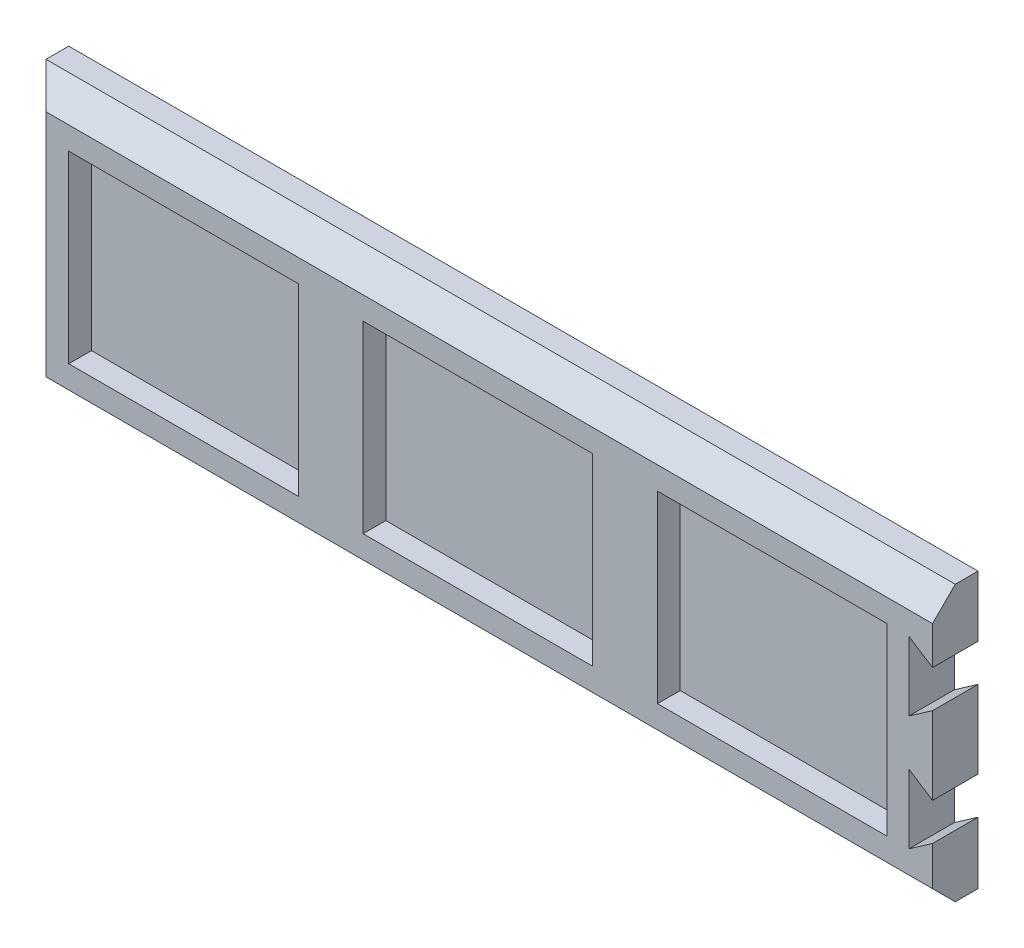
ISO-10303-21;
HEADER;
FILE_DESCRIPTION(('STEP AP214'),'2;1');
FILE_NAME('part.step','',(''),(''),'','','');
FILE_SCHEMA(('AUTOMOTIVE_DESIGN { 1 0 10303 214 1 1 1 1 }'));
ENDSEC;
DATA;
#1=APPLICATION_CONTEXT('core data for automotive mechanical design processes');
#2=APPLICATION_PROTOCOL_DEFINITION('international standard','automotive_design',2000,#1);
#3=PRODUCT_CONTEXT('',#1,'mechanical');
#4=PRODUCT('Part','Part','',(#3));
#5=PRODUCT_RELATED_PRODUCT_CATEGORY('part','',(#4));
#6=PRODUCT_DEFINITION_FORMATION('','',#4);
#7=PRODUCT_DEFINITION_CONTEXT('part definition',#1,'design');
#8=PRODUCT_DEFINITION('design','',#6,#7);
#9=PRODUCT_DEFINITION_SHAPE('','',#8);
#10=(LENGTH_UNIT() NAMED_UNIT(*) SI_UNIT(.MILLI.,.METRE.));
#11=(NAMED_UNIT(*) PLANE_ANGLE_UNIT() SI_UNIT($,.RADIAN.));
#12=(NAMED_UNIT(*) SI_UNIT($,.STERADIAN.) SOLID_ANGLE_UNIT());
#13=UNCERTAINTY_MEASURE_WITH_UNIT(LENGTH_MEASURE(1.E-05),#10,'distance_accuracy_value','');
#14=(GEOMETRIC_REPRESENTATION_CONTEXT(3) GLOBAL_UNCERTAINTY_ASSIGNED_CONTEXT((#13)) GLOBAL_UNIT_ASSIGNED_CONTEXT((#10,
#11,#12)) REPRESENTATION_CONTEXT('',''));
#15=CARTESIAN_POINT('',(0.,0.,0.));
#16=DIRECTION('',(0.,0.,1.));
#17=DIRECTION('',(1.,0.,0.));
#18=AXIS2_PLACEMENT_3D('',#15,#16,#17);
#19=CARTESIAN_POINT('',(200.,30.25,10.));
#20=DIRECTION('',(-1.,0.,0.));
#21=DIRECTION('',(0.,0.,1.));
#22=AXIS2_PLACEMENT_3D('',#19,#20,#21);
#23=PLANE('',#22);
#24=DIRECTION('',(0.,1.,0.));
#25=VECTOR('',#24,1.);
#26=CARTESIAN_POINT('',(200.,30.25,0.));
#27=LINE('',#26,#25);
#28=CARTESIAN_POINT('',(200.,-8.426374254982,0.));
#29=VERTEX_POINT('',#28);
#30=CARTESIAN_POINT('',(200.,8.673625745018,0.));
#31=VERTEX_POINT('',#30);
#32=EDGE_CURVE('E238',#29,#31,#27,.T.);
#33=ORIENTED_EDGE('',*,*,#32,.T.);
#34=DIRECTION('',(0.,0.,1.));
#35=VECTOR('',#34,1.);
#36=CARTESIAN_POINT('',(200.,8.673625745018,0.));
#37=LINE('',#36,#35);
#38=CARTESIAN_POINT('',(200.,8.673625745018,10.));
#39=VERTEX_POINT('',#38);
#40=EDGE_CURVE('E280',#31,#39,#37,.T.);
#41=ORIENTED_EDGE('',*,*,#40,.T.);
#42=DIRECTION('',(0.,1.,0.));
#43=VECTOR('',#42,1.);
#44=CARTESIAN_POINT('',(200.,30.25,10.));
#45=LINE('',#44,#43);
#46=CARTESIAN_POINT('',(200.,-8.426374254982,10.));
#47=VERTEX_POINT('',#46);
#48=EDGE_CURVE('E253',#47,#39,#45,.T.);
#49=ORIENTED_EDGE('',*,*,#48,.F.);
#50=DIRECTION('',(0.,0.,1.));
#51=VECTOR('',#50,1.);
#52=CARTESIAN_POINT('',(200.,-8.426374254982,0.));
#53=LINE('',#52,#51);
#54=EDGE_CURVE('E306',#29,#47,#53,.T.);
#55=ORIENTED_EDGE('',*,*,#54,.F.);
#56=EDGE_LOOP('',(#33,#41,#49,#55));
#57=FACE_BOUND('',#56,.T.);
#58=ADVANCED_FACE('F38',(#57),#23,.F.);
#59=CARTESIAN_POINT('',(200.,-30.25,0.));
#60=VERTEX_POINT('',#59);
#61=CARTESIAN_POINT('',(200.,-16.626374254982,0.));
#62=VERTEX_POINT('',#61);
#63=EDGE_CURVE('E241',#60,#62,#27,.T.);
#64=ORIENTED_EDGE('',*,*,#63,.T.);
#65=DIRECTION('',(0.,0.,1.));
#66=VECTOR('',#65,1.);
#67=CARTESIAN_POINT('',(200.,-16.626374254982,0.));
#68=LINE('',#67,#66);
#69=CARTESIAN_POINT('',(200.,-16.626374254982,10.));
#70=VERTEX_POINT('',#69);
#71=EDGE_CURVE('E314',#62,#70,#68,.T.);
#72=ORIENTED_EDGE('',*,*,#71,.T.);
#73=CARTESIAN_POINT('',(200.,-25.25,10.));
#74=VERTEX_POINT('',#73);
#75=EDGE_CURVE('E255',#74,#70,#45,.T.);
#76=ORIENTED_EDGE('',*,*,#75,.F.);
#77=DIRECTION('',(0.,-0.707106781186546,-0.707106781186549));
#78=VECTOR('',#77,1.);
#79=CARTESIAN_POINT('',(200.,-25.25,10.));
#80=LINE('',#79,#78);
#81=CARTESIAN_POINT('',(200.,-30.25,4.99999999999994));
#82=VERTEX_POINT('',#81);
#83=EDGE_CURVE('E274',#74,#82,#80,.T.);
#84=ORIENTED_EDGE('',*,*,#83,.T.);
#85=DIRECTION('',(0.,0.,-1.));
#86=VECTOR('',#85,1.);
#87=CARTESIAN_POINT('',(200.,-30.25,10.));
#88=LINE('',#87,#86);
#89=EDGE_CURVE('E261',#82,#60,#88,.T.);
#90=ORIENTED_EDGE('',*,*,#89,.T.);
#91=EDGE_LOOP('',(#64,#72,#76,#84,#90));
#92=FACE_BOUND('',#91,.T.);
#93=ADVANCED_FACE('F435',(#92),#23,.F.);
#94=CARTESIAN_POINT('',(0.,30.25,10.));
#95=DIRECTION('',(1.,0.,0.));
#96=DIRECTION('',(0.,0.,-1.));
#97=AXIS2_PLACEMENT_3D('',#94,#95,#96);
#98=PLANE('',#97);
#99=DIRECTION('',(0.,0.,-1.));
#100=VECTOR('',#99,1.);
#101=CARTESIAN_POINT('',(0.,-30.25,10.));
#102=LINE('',#101,#100);
#103=CARTESIAN_POINT('',(0.,-30.25,4.99999999999994));
#104=VERTEX_POINT('',#103);
#105=CARTESIAN_POINT('',(0.,-30.25,0.));
#106=VERTEX_POINT('',#105);
#107=EDGE_CURVE('E263',#104,#106,#102,.T.);
#108=ORIENTED_EDGE('',*,*,#107,.F.);
#109=DIRECTION('',(0.,1.,0.));
#110=VECTOR('',#109,1.);
#111=CARTESIAN_POINT('',(0.,30.25,4.99999999999994));
#112=LINE('',#111,#110);
#113=CARTESIAN_POINT('',(0.,30.25,4.99999999999994));
#114=VERTEX_POINT('',#113);
#115=EDGE_CURVE('E11',#104,#114,#112,.T.);
#116=ORIENTED_EDGE('',*,*,#115,.T.);
#117=DIRECTION('',(0.,0.,-1.));
#118=VECTOR('',#117,1.);
#119=CARTESIAN_POINT('',(0.,30.25,10.));
#120=LINE('',#119,#118);
#121=CARTESIAN_POINT('',(0.,30.25,0.));
#122=VERTEX_POINT('',#121);
#123=EDGE_CURVE('E257',#114,#122,#120,.T.);
#124=ORIENTED_EDGE('',*,*,#123,.T.);
#125=DIRECTION('',(0.,-1.,0.));
#126=VECTOR('',#125,1.);
#127=CARTESIAN_POINT('',(0.,30.25,0.));
#128=LINE('',#127,#126);
#129=EDGE_CURVE('E244',#122,#106,#128,.T.);
#130=ORIENTED_EDGE('',*,*,#129,.T.);
#131=EDGE_LOOP('',(#108,#116,#124,#130));
#132=FACE_BOUND('',#131,.T.);
#133=ADVANCED_FACE('F421',(#132),#98,.F.);
#134=CARTESIAN_POINT('',(0.,-30.25,10.));
#135=DIRECTION('',(0.,1.,0.));
#136=DIRECTION('',(0.,0.,1.));
#137=AXIS2_PLACEMENT_3D('',#134,#135,#136);
#138=PLANE('',#137);
#139=ORIENTED_EDGE('',*,*,#89,.F.);
#140=DIRECTION('',(-1.,0.,0.));
#141=VECTOR('',#140,1.);
#142=CARTESIAN_POINT('',(0.,-30.25,4.99999999999994));
#143=LINE('',#142,#141);
#144=EDGE_CURVE('E276',#82,#104,#143,.T.);
#145=ORIENTED_EDGE('',*,*,#144,.T.);
#146=ORIENTED_EDGE('',*,*,#107,.T.);
#147=DIRECTION('',(1.,0.,0.));
#148=VECTOR('',#147,1.);
#149=CARTESIAN_POINT('',(0.,-30.25,0.));
#150=LINE('',#149,#148);
#151=EDGE_CURVE('E239',#106,#60,#150,.T.);
#152=ORIENTED_EDGE('',*,*,#151,.T.);
#153=EDGE_LOOP('',(#139,#145,#146,#152));
#154=FACE_BOUND('',#153,.T.);
#155=ADVANCED_FACE('F426',(#154),#138,.F.);
#156=CARTESIAN_POINT('',(200.,16.873625745018,10.));
#157=VERTEX_POINT('',#156);
#158=CARTESIAN_POINT('',(200.,25.25,10.));
#159=VERTEX_POINT('',#158);
#160=EDGE_CURVE('E230',#157,#159,#45,.T.);
#161=ORIENTED_EDGE('',*,*,#160,.F.);
#162=DIRECTION('',(0.,0.,1.));
#163=VECTOR('',#162,1.);
#164=CARTESIAN_POINT('',(200.,16.873625745018,0.));
#165=LINE('',#164,#163);
#166=CARTESIAN_POINT('',(200.,16.873625745018,0.));
#167=VERTEX_POINT('',#166);
#168=EDGE_CURVE('E216',#167,#157,#165,.T.);
#169=ORIENTED_EDGE('',*,*,#168,.F.);
#170=CARTESIAN_POINT('',(200.,30.25,0.));
#171=VERTEX_POINT('',#170);
#172=EDGE_CURVE('E227',#167,#171,#27,.T.);
#173=ORIENTED_EDGE('',*,*,#172,.T.);
#174=DIRECTION('',(0.,0.,-1.));
#175=VECTOR('',#174,1.);
#176=CARTESIAN_POINT('',(200.,30.25,10.));
#177=LINE('',#176,#175);
#178=CARTESIAN_POINT('',(200.,30.25,4.99999999999994));
#179=VERTEX_POINT('',#178);
#180=EDGE_CURVE('E259',#179,#171,#177,.T.);
#181=ORIENTED_EDGE('',*,*,#180,.F.);
#182=DIRECTION('',(0.,-0.707106781186546,0.707106781186549));
#183=VECTOR('',#182,1.);
#184=CARTESIAN_POINT('',(200.,25.25,10.));
#185=LINE('',#184,#183);
#186=EDGE_CURVE('E272',#179,#159,#185,.T.);
#187=ORIENTED_EDGE('',*,*,#186,.T.);
#188=EDGE_LOOP('',(#161,#169,#173,#181,#187));
#189=FACE_BOUND('',#188,.T.);
#190=ADVANCED_FACE('F225',(#189),#23,.F.);
#191=CARTESIAN_POINT('',(0.,30.25,10.));
#192=DIRECTION('',(0.,-1.,0.));
#193=DIRECTION('',(0.,0.,-1.));
#194=AXIS2_PLACEMENT_3D('',#191,#192,#193);
#195=PLANE('',#194);
#196=ORIENTED_EDGE('',*,*,#123,.F.);
#197=DIRECTION('',(1.,0.,0.));
#198=VECTOR('',#197,1.);
#199=CARTESIAN_POINT('',(200.,30.25,4.99999999999994));
#200=LINE('',#199,#198);
#201=EDGE_CURVE('E48',#114,#179,#200,.T.);
#202=ORIENTED_EDGE('',*,*,#201,.T.);
#203=ORIENTED_EDGE('',*,*,#180,.T.);
#204=DIRECTION('',(-1.,0.,0.));
#205=VECTOR('',#204,1.);
#206=CARTESIAN_POINT('',(0.,30.25,0.));
#207=LINE('',#206,#205);
#208=EDGE_CURVE('E237',#171,#122,#207,.T.);
#209=ORIENTED_EDGE('',*,*,#208,.T.);
#210=EDGE_LOOP('',(#196,#202,#203,#209));
#211=FACE_BOUND('',#210,.T.);
#212=ADVANCED_FACE('F465',(#211),#195,.F.);
#213=CARTESIAN_POINT('',(0.,0.,10.));
#214=DIRECTION('',(0.,0.,1.));
#215=DIRECTION('',(1.,0.,0.));
#216=AXIS2_PLACEMENT_3D('',#213,#214,#215);
#217=PLANE('',#216);
#218=DIRECTION('',(0.820443806514334,0.571727173004982,0.));
#219=VECTOR('',#218,1.);
#220=CARTESIAN_POINT('',(194.8,5.05,10.));
#221=LINE('',#220,#219);
#222=CARTESIAN_POINT('',(194.8,5.05,10.));
#223=VERTEX_POINT('',#222);
#224=EDGE_CURVE('E221',#223,#39,#221,.T.);
#225=ORIENTED_EDGE('',*,*,#224,.F.);
#226=DIRECTION('',(0.,-1.,0.));
#227=VECTOR('',#226,1.);
#228=CARTESIAN_POINT('',(194.8,20.25,10.));
#229=LINE('',#228,#227);
#230=CARTESIAN_POINT('',(194.8,20.25,10.));
#231=VERTEX_POINT('',#230);
#232=EDGE_CURVE('E495',#231,#223,#229,.T.);
#233=ORIENTED_EDGE('',*,*,#232,.F.);
#234=DIRECTION('',(-0.838710734430041,0.544577179058966,0.));
#235=VECTOR('',#234,1.);
#236=CARTESIAN_POINT('',(200.,16.873625745018,10.));
#237=LINE('',#236,#235);
#238=EDGE_CURVE('E316',#157,#231,#237,.T.);
#239=ORIENTED_EDGE('',*,*,#238,.F.);
#240=ORIENTED_EDGE('',*,*,#160,.T.);
#241=DIRECTION('',(-1.,0.,0.));
#242=VECTOR('',#241,1.);
#243=CARTESIAN_POINT('',(0.,25.25,10.));
#244=LINE('',#243,#242);
#245=CARTESIAN_POINT('',(5.00000000000003,25.25,10.));
#246=VERTEX_POINT('',#245);
#247=EDGE_CURVE('E267',#159,#246,#244,.T.);
#248=ORIENTED_EDGE('',*,*,#247,.T.);
#249=DIRECTION('',(0.,-1.,0.));
#250=VECTOR('',#249,1.);
#251=CARTESIAN_POINT('',(5.00000000000003,-30.25,10.));
#252=LINE('',#251,#250);
#253=CARTESIAN_POINT('',(5.00000000000003,-25.25,10.));
#254=VERTEX_POINT('',#253);
#255=EDGE_CURVE('E265',#246,#254,#252,.T.);
#256=ORIENTED_EDGE('',*,*,#255,.T.);
#257=DIRECTION('',(1.,0.,0.));
#258=VECTOR('',#257,1.);
#259=CARTESIAN_POINT('',(200.,-25.25,10.));
#260=LINE('',#259,#258);
#261=EDGE_CURVE('E269',#254,#74,#260,.T.);
#262=ORIENTED_EDGE('',*,*,#261,.T.);
#263=ORIENTED_EDGE('',*,*,#75,.T.);
#264=DIRECTION('',(0.820443806514335,0.571727173004982,0.));
#265=VECTOR('',#264,1.);
#266=CARTESIAN_POINT('',(194.8,-20.25,10.));
#267=LINE('',#266,#265);
#268=CARTESIAN_POINT('',(194.8,-20.25,10.));
#269=VERTEX_POINT('',#268);
#270=EDGE_CURVE('E301',#269,#70,#267,.T.);
#271=ORIENTED_EDGE('',*,*,#270,.F.);
#272=DIRECTION('',(0.,-1.,0.));
#273=VECTOR('',#272,1.);
#274=CARTESIAN_POINT('',(194.8,-5.05,10.));
#275=LINE('',#274,#273);
#276=CARTESIAN_POINT('',(194.8,-5.05,10.));
#277=VERTEX_POINT('',#276);
#278=EDGE_CURVE('E310',#277,#269,#275,.T.);
#279=ORIENTED_EDGE('',*,*,#278,.F.);
#280=DIRECTION('',(-0.83871073443004,0.544577179058967,0.));
#281=VECTOR('',#280,1.);
#282=CARTESIAN_POINT('',(200.,-8.426374254982,10.));
#283=LINE('',#282,#281);
#284=EDGE_CURVE('E307',#47,#277,#283,.T.);
#285=ORIENTED_EDGE('',*,*,#284,.F.);
#286=ORIENTED_EDGE('',*,*,#48,.T.);
#287=EDGE_LOOP('',(#225,#233,#239,#240,#248,#256,#262,#263,#271,#279,#285,#286));
#288=FACE_BOUND('',#287,.T.);
#289=DIRECTION('',(0.,-1.,0.));
#290=VECTOR('',#289,1.);
#291=CARTESIAN_POINT('',(10.,20.25,10.));
#292=LINE('',#291,#290);
#293=CARTESIAN_POINT('',(10.,20.25,10.));
#294=VERTEX_POINT('',#293);
#295=CARTESIAN_POINT('',(10.,-20.25,10.));
#296=VERTEX_POINT('',#295);
#297=EDGE_CURVE('E336',#294,#296,#292,.T.);
#298=ORIENTED_EDGE('',*,*,#297,.F.);
#299=DIRECTION('',(-1.,0.,0.));
#300=VECTOR('',#299,1.);
#301=CARTESIAN_POINT('',(10.,20.25,10.));
#302=LINE('',#301,#300);
#303=CARTESIAN_POINT('',(60.5,20.25,10.));
#304=VERTEX_POINT('',#303);
#305=EDGE_CURVE('E326',#304,#294,#302,.T.);
#306=ORIENTED_EDGE('',*,*,#305,.F.);
#307=DIRECTION('',(0.,1.,0.));
#308=VECTOR('',#307,1.);
#309=CARTESIAN_POINT('',(60.5,20.25,10.));
#310=LINE('',#309,#308);
#311=CARTESIAN_POINT('',(60.5,-20.25,10.));
#312=VERTEX_POINT('',#311);
#313=EDGE_CURVE('E342',#312,#304,#310,.T.);
#314=ORIENTED_EDGE('',*,*,#313,.F.);
#315=DIRECTION('',(1.,0.,0.));
#316=VECTOR('',#315,1.);
#317=CARTESIAN_POINT('',(10.,-20.25,10.));
#318=LINE('',#317,#316);
#319=EDGE_CURVE('E338',#296,#312,#318,.T.);
#320=ORIENTED_EDGE('',*,*,#319,.F.);
#321=EDGE_LOOP('',(#298,#306,#314,#320));
#322=FACE_BOUND('',#321,.T.);
#323=DIRECTION('',(-1.,0.,0.));
#324=VECTOR('',#323,1.);
#325=CARTESIAN_POINT('',(74.75,20.25,10.));
#326=LINE('',#325,#324);
#327=CARTESIAN_POINT('',(125.25,20.25,10.));
#328=VERTEX_POINT('',#327);
#329=CARTESIAN_POINT('',(74.75,20.25,10.));
#330=VERTEX_POINT('',#329);
#331=EDGE_CURVE('E369',#328,#330,#326,.T.);
#332=ORIENTED_EDGE('',*,*,#331,.F.);
#333=DIRECTION('',(0.,1.,0.));
#334=VECTOR('',#333,1.);
#335=CARTESIAN_POINT('',(125.25,20.25,10.));
#336=LINE('',#335,#334);
#337=CARTESIAN_POINT('',(125.25,-20.25,10.));
#338=VERTEX_POINT('',#337);
#339=EDGE_CURVE('E359',#338,#328,#336,.T.);
#340=ORIENTED_EDGE('',*,*,#339,.F.);
#341=DIRECTION('',(1.,0.,0.));
#342=VECTOR('',#341,1.);
#343=CARTESIAN_POINT('',(74.75,-20.25,10.));
#344=LINE('',#343,#342);
#345=CARTESIAN_POINT('',(74.75,-20.25,10.));
#346=VERTEX_POINT('',#345);
#347=EDGE_CURVE('E375',#346,#338,#344,.T.);
#348=ORIENTED_EDGE('',*,*,#347,.F.);
#349=DIRECTION('',(0.,-1.,0.));
#350=VECTOR('',#349,1.);
#351=CARTESIAN_POINT('',(74.75,20.25,10.));
#352=LINE('',#351,#350);
#353=EDGE_CURVE('E371',#330,#346,#352,.T.);
#354=ORIENTED_EDGE('',*,*,#353,.F.);
#355=EDGE_LOOP('',(#332,#340,#348,#354));
#356=FACE_BOUND('',#355,.T.);
#357=DIRECTION('',(-1.,0.,0.));
#358=VECTOR('',#357,1.);
#359=CARTESIAN_POINT('',(139.5,20.25,10.));
#360=LINE('',#359,#358);
#361=CARTESIAN_POINT('',(190.,20.25,10.));
#362=VERTEX_POINT('',#361);
#363=CARTESIAN_POINT('',(139.5,20.25,10.));
#364=VERTEX_POINT('',#363);
#365=EDGE_CURVE('E286',#362,#364,#360,.T.);
#366=ORIENTED_EDGE('',*,*,#365,.F.);
#367=DIRECTION('',(0.,1.,0.));
#368=VECTOR('',#367,1.);
#369=CARTESIAN_POINT('',(190.,20.25,10.));
#370=LINE('',#369,#368);
#371=CARTESIAN_POINT('',(190.,-20.25,10.));
#372=VERTEX_POINT('',#371);
#373=EDGE_CURVE('E391',#372,#362,#370,.T.);
#374=ORIENTED_EDGE('',*,*,#373,.F.);
#375=DIRECTION('',(1.,0.,0.));
#376=VECTOR('',#375,1.);
#377=CARTESIAN_POINT('',(139.5,-20.25,10.));
#378=LINE('',#377,#376);
#379=CARTESIAN_POINT('',(139.5,-20.25,10.));
#380=VERTEX_POINT('',#379);
#381=EDGE_CURVE('E405',#380,#372,#378,.T.);
#382=ORIENTED_EDGE('',*,*,#381,.F.);
#383=DIRECTION('',(0.,-1.,0.));
#384=VECTOR('',#383,1.);
#385=CARTESIAN_POINT('',(139.5,20.25,10.));
#386=LINE('',#385,#384);
#387=EDGE_CURVE('E402',#364,#380,#386,.T.);
#388=ORIENTED_EDGE('',*,*,#387,.F.);
#389=EDGE_LOOP('',(#366,#374,#382,#388));
#390=FACE_BOUND('',#389,.T.);
#391=ADVANCED_FACE('F431',(#288,#322,#356,#390),#217,.T.);
#392=CARTESIAN_POINT('',(0.,0.,0.));
#393=DIRECTION('',(0.,0.,1.));
#394=DIRECTION('',(1.,0.,0.));
#395=AXIS2_PLACEMENT_3D('',#392,#393,#394);
#396=PLANE('',#395);
#397=DIRECTION('',(0.,-1.,0.));
#398=VECTOR('',#397,1.);
#399=CARTESIAN_POINT('',(194.8,20.25,0.));
#400=LINE('',#399,#398);
#401=CARTESIAN_POINT('',(194.8,20.25,0.));
#402=VERTEX_POINT('',#401);
#403=CARTESIAN_POINT('',(194.8,5.05,0.));
#404=VERTEX_POINT('',#403);
#405=EDGE_CURVE('E56',#402,#404,#400,.T.);
#406=ORIENTED_EDGE('',*,*,#405,.T.);
#407=DIRECTION('',(0.820443806514334,0.571727173004982,0.));
#408=VECTOR('',#407,1.);
#409=CARTESIAN_POINT('',(194.8,5.05,0.));
#410=LINE('',#409,#408);
#411=EDGE_CURVE('E231',#404,#31,#410,.T.);
#412=ORIENTED_EDGE('',*,*,#411,.T.);
#413=ORIENTED_EDGE('',*,*,#32,.F.);
#414=DIRECTION('',(-0.83871073443004,0.544577179058967,0.));
#415=VECTOR('',#414,1.);
#416=CARTESIAN_POINT('',(200.,-8.426374254982,0.));
#417=LINE('',#416,#415);
#418=CARTESIAN_POINT('',(194.8,-5.04999999999997,0.));
#419=VERTEX_POINT('',#418);
#420=EDGE_CURVE('E298',#29,#419,#417,.T.);
#421=ORIENTED_EDGE('',*,*,#420,.T.);
#422=DIRECTION('',(0.,-1.,0.));
#423=VECTOR('',#422,1.);
#424=CARTESIAN_POINT('',(194.8,-5.05,0.));
#425=LINE('',#424,#423);
#426=CARTESIAN_POINT('',(194.8,-20.25,0.));
#427=VERTEX_POINT('',#426);
#428=EDGE_CURVE('E64',#419,#427,#425,.T.);
#429=ORIENTED_EDGE('',*,*,#428,.T.);
#430=DIRECTION('',(0.820443806514335,0.571727173004982,0.));
#431=VECTOR('',#430,1.);
#432=CARTESIAN_POINT('',(194.8,-20.25,0.));
#433=LINE('',#432,#431);
#434=EDGE_CURVE('E303',#427,#62,#433,.T.);
#435=ORIENTED_EDGE('',*,*,#434,.T.);
#436=ORIENTED_EDGE('',*,*,#63,.F.);
#437=ORIENTED_EDGE('',*,*,#151,.F.);
#438=ORIENTED_EDGE('',*,*,#129,.F.);
#439=ORIENTED_EDGE('',*,*,#208,.F.);
#440=ORIENTED_EDGE('',*,*,#172,.F.);
#441=DIRECTION('',(-0.838710734430041,0.544577179058966,0.));
#442=VECTOR('',#441,1.);
#443=CARTESIAN_POINT('',(200.,16.873625745018,0.));
#444=LINE('',#443,#442);
#445=EDGE_CURVE('E212',#167,#402,#444,.T.);
#446=ORIENTED_EDGE('',*,*,#445,.T.);
#447=EDGE_LOOP('',(#406,#412,#413,#421,#429,#435,#436,#437,#438,#439,#440,#446));
#448=FACE_BOUND('',#447,.T.);
#449=ADVANCED_FACE('F234',(#448),#396,.F.);
#450=CARTESIAN_POINT('',(139.5,20.25,5.));
#451=DIRECTION('',(0.,1.,0.));
#452=DIRECTION('',(-1.,0.,0.));
#453=AXIS2_PLACEMENT_3D('',#450,#451,#452);
#454=PLANE('',#453);
#455=ORIENTED_EDGE('',*,*,#365,.T.);
#456=DIRECTION('',(0.,0.,1.));
#457=VECTOR('',#456,1.);
#458=CARTESIAN_POINT('',(139.5,20.25,5.));
#459=LINE('',#458,#457);
#460=CARTESIAN_POINT('',(139.5,20.25,5.));
#461=VERTEX_POINT('',#460);
#462=EDGE_CURVE('E400',#461,#364,#459,.T.);
#463=ORIENTED_EDGE('',*,*,#462,.F.);
#464=DIRECTION('',(-1.,0.,0.));
#465=VECTOR('',#464,1.);
#466=CARTESIAN_POINT('',(139.5,20.25,5.));
#467=LINE('',#466,#465);
#468=CARTESIAN_POINT('',(190.,20.25,5.));
#469=VERTEX_POINT('',#468);
#470=EDGE_CURVE('E387',#469,#461,#467,.T.);
#471=ORIENTED_EDGE('',*,*,#470,.F.);
#472=DIRECTION('',(0.,0.,1.));
#473=VECTOR('',#472,1.);
#474=CARTESIAN_POINT('',(190.,20.25,5.));
#475=LINE('',#474,#473);
#476=EDGE_CURVE('E372',#469,#362,#475,.T.);
#477=ORIENTED_EDGE('',*,*,#476,.T.);
#478=EDGE_LOOP('',(#455,#463,#471,#477));
#479=FACE_BOUND('',#478,.T.);
#480=ADVANCED_FACE('F536',(#479),#454,.F.);
#481=CARTESIAN_POINT('',(190.,20.25,5.));
#482=DIRECTION('',(1.,0.,0.));
#483=DIRECTION('',(0.,0.,-1.));
#484=AXIS2_PLACEMENT_3D('',#481,#482,#483);
#485=PLANE('',#484);
#486=ORIENTED_EDGE('',*,*,#373,.T.);
#487=ORIENTED_EDGE('',*,*,#476,.F.);
#488=DIRECTION('',(0.,1.,0.));
#489=VECTOR('',#488,1.);
#490=CARTESIAN_POINT('',(190.,20.25,5.));
#491=LINE('',#490,#489);
#492=CARTESIAN_POINT('',(190.,-20.25,5.));
#493=VERTEX_POINT('',#492);
#494=EDGE_CURVE('E397',#493,#469,#491,.T.);
#495=ORIENTED_EDGE('',*,*,#494,.F.);
#496=DIRECTION('',(0.,0.,1.));
#497=VECTOR('',#496,1.);
#498=CARTESIAN_POINT('',(190.,-20.25,5.));
#499=LINE('',#498,#497);
#500=EDGE_CURVE('E411',#493,#372,#499,.T.);
#501=ORIENTED_EDGE('',*,*,#500,.T.);
#502=EDGE_LOOP('',(#486,#487,#495,#501));
#503=FACE_BOUND('',#502,.T.);
#504=ADVANCED_FACE('F720',(#503),#485,.F.);
#505=CARTESIAN_POINT('',(139.5,-20.25,5.));
#506=DIRECTION('',(0.,-1.,0.));
#507=DIRECTION('',(1.,0.,0.));
#508=AXIS2_PLACEMENT_3D('',#505,#506,#507);
#509=PLANE('',#508);
#510=ORIENTED_EDGE('',*,*,#381,.T.);
#511=ORIENTED_EDGE('',*,*,#500,.F.);
#512=DIRECTION('',(1.,0.,0.));
#513=VECTOR('',#512,1.);
#514=CARTESIAN_POINT('',(139.5,-20.25,5.));
#515=LINE('',#514,#513);
#516=CARTESIAN_POINT('',(139.5,-20.25,5.));
#517=VERTEX_POINT('',#516);
#518=EDGE_CURVE('E394',#517,#493,#515,.T.);
#519=ORIENTED_EDGE('',*,*,#518,.F.);
#520=DIRECTION('',(0.,0.,1.));
#521=VECTOR('',#520,1.);
#522=CARTESIAN_POINT('',(139.5,-20.25,5.));
#523=LINE('',#522,#521);
#524=EDGE_CURVE('E413',#517,#380,#523,.T.);
#525=ORIENTED_EDGE('',*,*,#524,.T.);
#526=EDGE_LOOP('',(#510,#511,#519,#525));
#527=FACE_BOUND('',#526,.T.);
#528=ADVANCED_FACE('F710',(#527),#509,.F.);
#529=CARTESIAN_POINT('',(139.5,20.25,5.));
#530=DIRECTION('',(-1.,0.,0.));
#531=DIRECTION('',(0.,0.,1.));
#532=AXIS2_PLACEMENT_3D('',#529,#530,#531);
#533=PLANE('',#532);
#534=ORIENTED_EDGE('',*,*,#387,.T.);
#535=ORIENTED_EDGE('',*,*,#524,.F.);
#536=DIRECTION('',(0.,-1.,0.));
#537=VECTOR('',#536,1.);
#538=CARTESIAN_POINT('',(139.5,20.25,5.));
#539=LINE('',#538,#537);
#540=EDGE_CURVE('E390',#461,#517,#539,.T.);
#541=ORIENTED_EDGE('',*,*,#540,.F.);
#542=ORIENTED_EDGE('',*,*,#462,.T.);
#543=EDGE_LOOP('',(#534,#535,#541,#542));
#544=FACE_BOUND('',#543,.T.);
#545=ADVANCED_FACE('F700',(#544),#533,.F.);
#546=CARTESIAN_POINT('',(0.,0.,5.));
#547=DIRECTION('',(0.,0.,-1.));
#548=DIRECTION('',(-1.,0.,0.));
#549=AXIS2_PLACEMENT_3D('',#546,#547,#548);
#550=PLANE('',#549);
#551=ORIENTED_EDGE('',*,*,#470,.T.);
#552=ORIENTED_EDGE('',*,*,#540,.T.);
#553=ORIENTED_EDGE('',*,*,#518,.T.);
#554=ORIENTED_EDGE('',*,*,#494,.T.);
#555=EDGE_LOOP('',(#551,#552,#553,#554));
#556=FACE_BOUND('',#555,.T.);
#557=ADVANCED_FACE('F690',(#556),#550,.F.);
#558=CARTESIAN_POINT('',(74.75,20.25,5.));
#559=DIRECTION('',(0.,1.,0.));
#560=DIRECTION('',(-1.,0.,0.));
#561=AXIS2_PLACEMENT_3D('',#558,#559,#560);
#562=PLANE('',#561);
#563=ORIENTED_EDGE('',*,*,#331,.T.);
#564=DIRECTION('',(0.,0.,1.));
#565=VECTOR('',#564,1.);
#566=CARTESIAN_POINT('',(74.75,20.25,5.));
#567=LINE('',#566,#565);
#568=CARTESIAN_POINT('',(74.75,20.25,5.));
#569=VERTEX_POINT('',#568);
#570=EDGE_CURVE('E368',#569,#330,#567,.T.);
#571=ORIENTED_EDGE('',*,*,#570,.F.);
#572=DIRECTION('',(-1.,0.,0.));
#573=VECTOR('',#572,1.);
#574=CARTESIAN_POINT('',(74.75,20.25,5.));
#575=LINE('',#574,#573);
#576=CARTESIAN_POINT('',(125.25,20.25,5.));
#577=VERTEX_POINT('',#576);
#578=EDGE_CURVE('E355',#577,#569,#575,.T.);
#579=ORIENTED_EDGE('',*,*,#578,.F.);
#580=DIRECTION('',(0.,0.,1.));
#581=VECTOR('',#580,1.);
#582=CARTESIAN_POINT('',(125.25,20.25,5.));
#583=LINE('',#582,#581);
#584=EDGE_CURVE('E339',#577,#328,#583,.T.);
#585=ORIENTED_EDGE('',*,*,#584,.T.);
#586=EDGE_LOOP('',(#563,#571,#579,#585));
#587=FACE_BOUND('',#586,.T.);
#588=ADVANCED_FACE('F680',(#587),#562,.F.);
#589=CARTESIAN_POINT('',(125.25,20.25,5.));
#590=DIRECTION('',(1.,0.,0.));
#591=DIRECTION('',(0.,0.,-1.));
#592=AXIS2_PLACEMENT_3D('',#589,#590,#591);
#593=PLANE('',#592);
#594=ORIENTED_EDGE('',*,*,#339,.T.);
#595=ORIENTED_EDGE('',*,*,#584,.F.);
#596=DIRECTION('',(0.,1.,0.));
#597=VECTOR('',#596,1.);
#598=CARTESIAN_POINT('',(125.25,20.25,5.));
#599=LINE('',#598,#597);
#600=CARTESIAN_POINT('',(125.25,-20.25,5.));
#601=VERTEX_POINT('',#600);
#602=EDGE_CURVE('E365',#601,#577,#599,.T.);
#603=ORIENTED_EDGE('',*,*,#602,.F.);
#604=DIRECTION('',(0.,0.,1.));
#605=VECTOR('',#604,1.);
#606=CARTESIAN_POINT('',(125.25,-20.25,5.));
#607=LINE('',#606,#605);
#608=EDGE_CURVE('E381',#601,#338,#607,.T.);
#609=ORIENTED_EDGE('',*,*,#608,.T.);
#610=EDGE_LOOP('',(#594,#595,#603,#609));
#611=FACE_BOUND('',#610,.T.);
#612=ADVANCED_FACE('F670',(#611),#593,.F.);
#613=CARTESIAN_POINT('',(74.75,-20.25,5.));
#614=DIRECTION('',(0.,-1.,0.));
#615=DIRECTION('',(1.,0.,0.));
#616=AXIS2_PLACEMENT_3D('',#613,#614,#615);
#617=PLANE('',#616);
#618=ORIENTED_EDGE('',*,*,#347,.T.);
#619=ORIENTED_EDGE('',*,*,#608,.F.);
#620=DIRECTION('',(1.,0.,0.));
#621=VECTOR('',#620,1.);
#622=CARTESIAN_POINT('',(74.75,-20.25,5.));
#623=LINE('',#622,#621);
#624=CARTESIAN_POINT('',(74.75,-20.25,5.));
#625=VERTEX_POINT('',#624);
#626=EDGE_CURVE('E362',#625,#601,#623,.T.);
#627=ORIENTED_EDGE('',*,*,#626,.F.);
#628=DIRECTION('',(0.,0.,1.));
#629=VECTOR('',#628,1.);
#630=CARTESIAN_POINT('',(74.75,-20.25,5.));
#631=LINE('',#630,#629);
#632=EDGE_CURVE('E383',#625,#346,#631,.T.);
#633=ORIENTED_EDGE('',*,*,#632,.T.);
#634=EDGE_LOOP('',(#618,#619,#627,#633));
#635=FACE_BOUND('',#634,.T.);
#636=ADVANCED_FACE('F660',(#635),#617,.F.);
#637=CARTESIAN_POINT('',(74.75,20.25,5.));
#638=DIRECTION('',(-1.,0.,0.));
#639=DIRECTION('',(0.,0.,1.));
#640=AXIS2_PLACEMENT_3D('',#637,#638,#639);
#641=PLANE('',#640);
#642=ORIENTED_EDGE('',*,*,#353,.T.);
#643=ORIENTED_EDGE('',*,*,#632,.F.);
#644=DIRECTION('',(0.,-1.,0.));
#645=VECTOR('',#644,1.);
#646=CARTESIAN_POINT('',(74.75,20.25,5.));
#647=LINE('',#646,#645);
#648=EDGE_CURVE('E358',#569,#625,#647,.T.);
#649=ORIENTED_EDGE('',*,*,#648,.F.);
#650=ORIENTED_EDGE('',*,*,#570,.T.);
#651=EDGE_LOOP('',(#642,#643,#649,#650));
#652=FACE_BOUND('',#651,.T.);
#653=ADVANCED_FACE('F650',(#652),#641,.F.);
#654=CARTESIAN_POINT('',(0.,0.,5.));
#655=DIRECTION('',(0.,0.,-1.));
#656=DIRECTION('',(-1.,0.,0.));
#657=AXIS2_PLACEMENT_3D('',#654,#655,#656);
#658=PLANE('',#657);
#659=ORIENTED_EDGE('',*,*,#578,.T.);
#660=ORIENTED_EDGE('',*,*,#648,.T.);
#661=ORIENTED_EDGE('',*,*,#626,.T.);
#662=ORIENTED_EDGE('',*,*,#602,.T.);
#663=EDGE_LOOP('',(#659,#660,#661,#662));
#664=FACE_BOUND('',#663,.T.);
#665=ADVANCED_FACE('F640',(#664),#658,.F.);
#666=CARTESIAN_POINT('',(10.,20.25,5.));
#667=DIRECTION('',(-1.,0.,0.));
#668=DIRECTION('',(0.,0.,1.));
#669=AXIS2_PLACEMENT_3D('',#666,#667,#668);
#670=PLANE('',#669);
#671=ORIENTED_EDGE('',*,*,#297,.T.);
#672=DIRECTION('',(0.,0.,1.));
#673=VECTOR('',#672,1.);
#674=CARTESIAN_POINT('',(10.,-20.25,5.));
#675=LINE('',#674,#673);
#676=CARTESIAN_POINT('',(10.,-20.25,5.));
#677=VERTEX_POINT('',#676);
#678=EDGE_CURVE('E335',#677,#296,#675,.T.);
#679=ORIENTED_EDGE('',*,*,#678,.F.);
#680=DIRECTION('',(0.,-1.,0.));
#681=VECTOR('',#680,1.);
#682=CARTESIAN_POINT('',(10.,20.25,5.));
#683=LINE('',#682,#681);
#684=CARTESIAN_POINT('',(10.,20.25,5.));
#685=VERTEX_POINT('',#684);
#686=EDGE_CURVE('E322',#685,#677,#683,.T.);
#687=ORIENTED_EDGE('',*,*,#686,.F.);
#688=DIRECTION('',(0.,0.,1.));
#689=VECTOR('',#688,1.);
#690=CARTESIAN_POINT('',(10.,20.25,5.));
#691=LINE('',#690,#689);
#692=EDGE_CURVE('E347',#685,#294,#691,.T.);
#693=ORIENTED_EDGE('',*,*,#692,.T.);
#694=EDGE_LOOP('',(#671,#679,#687,#693));
#695=FACE_BOUND('',#694,.T.);
#696=ADVANCED_FACE('F630',(#695),#670,.F.);
#697=CARTESIAN_POINT('',(10.,20.25,5.));
#698=DIRECTION('',(0.,1.,0.));
#699=DIRECTION('',(-1.,0.,0.));
#700=AXIS2_PLACEMENT_3D('',#697,#698,#699);
#701=PLANE('',#700);
#702=ORIENTED_EDGE('',*,*,#305,.T.);
#703=ORIENTED_EDGE('',*,*,#692,.F.);
#704=DIRECTION('',(-1.,0.,0.));
#705=VECTOR('',#704,1.);
#706=CARTESIAN_POINT('',(10.,20.25,5.));
#707=LINE('',#706,#705);
#708=CARTESIAN_POINT('',(60.5,20.25,5.));
#709=VERTEX_POINT('',#708);
#710=EDGE_CURVE('E332',#709,#685,#707,.T.);
#711=ORIENTED_EDGE('',*,*,#710,.F.);
#712=DIRECTION('',(0.,0.,1.));
#713=VECTOR('',#712,1.);
#714=CARTESIAN_POINT('',(60.5,20.25,5.));
#715=LINE('',#714,#713);
#716=EDGE_CURVE('E349',#709,#304,#715,.T.);
#717=ORIENTED_EDGE('',*,*,#716,.T.);
#718=EDGE_LOOP('',(#702,#703,#711,#717));
#719=FACE_BOUND('',#718,.T.);
#720=ADVANCED_FACE('F620',(#719),#701,.F.);
#721=CARTESIAN_POINT('',(60.5,20.25,5.));
#722=DIRECTION('',(1.,0.,0.));
#723=DIRECTION('',(0.,0.,-1.));
#724=AXIS2_PLACEMENT_3D('',#721,#722,#723);
#725=PLANE('',#724);
#726=ORIENTED_EDGE('',*,*,#313,.T.);
#727=ORIENTED_EDGE('',*,*,#716,.F.);
#728=DIRECTION('',(0.,1.,0.));
#729=VECTOR('',#728,1.);
#730=CARTESIAN_POINT('',(60.5,20.25,5.));
#731=LINE('',#730,#729);
#732=CARTESIAN_POINT('',(60.5,-20.25,5.));
#733=VERTEX_POINT('',#732);
#734=EDGE_CURVE('E329',#733,#709,#731,.T.);
#735=ORIENTED_EDGE('',*,*,#734,.F.);
#736=DIRECTION('',(0.,0.,1.));
#737=VECTOR('',#736,1.);
#738=CARTESIAN_POINT('',(60.5,-20.25,5.));
#739=LINE('',#738,#737);
#740=EDGE_CURVE('E351',#733,#312,#739,.T.);
#741=ORIENTED_EDGE('',*,*,#740,.T.);
#742=EDGE_LOOP('',(#726,#727,#735,#741));
#743=FACE_BOUND('',#742,.T.);
#744=ADVANCED_FACE('F610',(#743),#725,.F.);
#745=CARTESIAN_POINT('',(10.,-20.25,5.));
#746=DIRECTION('',(0.,-1.,0.));
#747=DIRECTION('',(1.,0.,0.));
#748=AXIS2_PLACEMENT_3D('',#745,#746,#747);
#749=PLANE('',#748);
#750=ORIENTED_EDGE('',*,*,#319,.T.);
#751=ORIENTED_EDGE('',*,*,#740,.F.);
#752=DIRECTION('',(1.,0.,0.));
#753=VECTOR('',#752,1.);
#754=CARTESIAN_POINT('',(10.,-20.25,5.));
#755=LINE('',#754,#753);
#756=EDGE_CURVE('E325',#677,#733,#755,.T.);
#757=ORIENTED_EDGE('',*,*,#756,.F.);
#758=ORIENTED_EDGE('',*,*,#678,.T.);
#759=EDGE_LOOP('',(#750,#751,#757,#758));
#760=FACE_BOUND('',#759,.T.);
#761=ADVANCED_FACE('F600',(#760),#749,.F.);
#762=CARTESIAN_POINT('',(0.,0.,5.));
#763=DIRECTION('',(0.,0.,1.));
#764=DIRECTION('',(1.,0.,0.));
#765=AXIS2_PLACEMENT_3D('',#762,#763,#764);
#766=PLANE('',#765);
#767=ORIENTED_EDGE('',*,*,#686,.T.);
#768=ORIENTED_EDGE('',*,*,#756,.T.);
#769=ORIENTED_EDGE('',*,*,#734,.T.);
#770=ORIENTED_EDGE('',*,*,#710,.T.);
#771=EDGE_LOOP('',(#767,#768,#769,#770));
#772=FACE_BOUND('',#771,.T.);
#773=ADVANCED_FACE('F488',(#772),#766,.T.);
#774=CARTESIAN_POINT('',(0.,25.25,10.));
#775=DIRECTION('',(0.,0.707106781186549,0.707106781186546));
#776=DIRECTION('',(1.,0.,0.));
#777=AXIS2_PLACEMENT_3D('',#774,#775,#776);
#778=PLANE('',#777);
#779=ORIENTED_EDGE('',*,*,#186,.F.);
#780=ORIENTED_EDGE('',*,*,#201,.F.);
#781=DIRECTION('',(-0.577350269189625,0.577350269189625,-0.577350269189628));
#782=VECTOR('',#781,1.);
#783=CARTESIAN_POINT('',(13.4166666666667,16.8333333333333,18.4166666666667));
#784=LINE('',#783,#782);
#785=EDGE_CURVE('E43',#246,#114,#784,.T.);
#786=ORIENTED_EDGE('',*,*,#785,.F.);
#787=ORIENTED_EDGE('',*,*,#247,.F.);
#788=EDGE_LOOP('',(#779,#780,#786,#787));
#789=FACE_BOUND('',#788,.T.);
#790=ADVANCED_FACE('F41',(#789),#778,.T.);
#791=CARTESIAN_POINT('',(5.00000000000003,0.,10.));
#792=DIRECTION('',(-0.707106781186549,0.,0.707106781186546));
#793=DIRECTION('',(0.,1.,0.));
#794=AXIS2_PLACEMENT_3D('',#791,#792,#793);
#795=PLANE('',#794);
#796=ORIENTED_EDGE('',*,*,#785,.T.);
#797=ORIENTED_EDGE('',*,*,#115,.F.);
#798=DIRECTION('',(0.577350269189625,0.577350269189625,0.577350269189628));
#799=VECTOR('',#798,1.);
#800=CARTESIAN_POINT('',(13.4166666666667,-16.8333333333333,18.4166666666667));
#801=LINE('',#800,#799);
#802=EDGE_CURVE('E278',#254,#104,#801,.F.);
#803=ORIENTED_EDGE('',*,*,#802,.F.);
#804=ORIENTED_EDGE('',*,*,#255,.F.);
#805=EDGE_LOOP('',(#796,#797,#803,#804));
#806=FACE_BOUND('',#805,.T.);
#807=ADVANCED_FACE('F480',(#806),#795,.T.);
#808=CARTESIAN_POINT('',(0.,-25.25,10.));
#809=DIRECTION('',(0.,-0.707106781186549,0.707106781186546));
#810=DIRECTION('',(-1.,0.,0.));
#811=AXIS2_PLACEMENT_3D('',#808,#809,#810);
#812=PLANE('',#811);
#813=ORIENTED_EDGE('',*,*,#802,.T.);
#814=ORIENTED_EDGE('',*,*,#144,.F.);
#815=ORIENTED_EDGE('',*,*,#83,.F.);
#816=ORIENTED_EDGE('',*,*,#261,.F.);
#817=EDGE_LOOP('',(#813,#814,#815,#816));
#818=FACE_BOUND('',#817,.T.);
#819=ADVANCED_FACE('F427',(#818),#812,.T.);
#820=CARTESIAN_POINT('',(194.8,-20.25,0.));
#821=DIRECTION('',(0.571727173004982,-0.820443806514335,0.));
#822=DIRECTION('',(0.820443806514335,0.571727173004982,0.));
#823=AXIS2_PLACEMENT_3D('',#820,#821,#822);
#824=PLANE('',#823);
#825=ORIENTED_EDGE('',*,*,#270,.T.);
#826=ORIENTED_EDGE('',*,*,#71,.F.);
#827=ORIENTED_EDGE('',*,*,#434,.F.);
#828=DIRECTION('',(0.,0.,1.));
#829=VECTOR('',#828,1.);
#830=CARTESIAN_POINT('',(194.8,-20.25,0.));
#831=LINE('',#830,#829);
#832=EDGE_CURVE('E317',#427,#269,#831,.T.);
#833=ORIENTED_EDGE('',*,*,#832,.T.);
#834=EDGE_LOOP('',(#825,#826,#827,#833));
#835=FACE_BOUND('',#834,.T.);
#836=ADVANCED_FACE('F438',(#835),#824,.F.);
#837=CARTESIAN_POINT('',(194.8,-5.05,0.));
#838=DIRECTION('',(-1.,0.,0.));
#839=DIRECTION('',(0.,0.,1.));
#840=AXIS2_PLACEMENT_3D('',#837,#838,#839);
#841=PLANE('',#840);
#842=ORIENTED_EDGE('',*,*,#278,.T.);
#843=ORIENTED_EDGE('',*,*,#832,.F.);
#844=ORIENTED_EDGE('',*,*,#428,.F.);
#845=DIRECTION('',(0.,0.,1.));
#846=VECTOR('',#845,1.);
#847=CARTESIAN_POINT('',(194.8,-5.05,0.));
#848=LINE('',#847,#846);
#849=EDGE_CURVE('E319',#419,#277,#848,.T.);
#850=ORIENTED_EDGE('',*,*,#849,.T.);
#851=EDGE_LOOP('',(#842,#843,#844,#850));
#852=FACE_BOUND('',#851,.T.);
#853=ADVANCED_FACE('F447',(#852),#841,.F.);
#854=CARTESIAN_POINT('',(200.,-8.426374254982,0.));
#855=DIRECTION('',(0.544577179058967,0.83871073443004,0.));
#856=DIRECTION('',(-0.83871073443004,0.544577179058967,0.));
#857=AXIS2_PLACEMENT_3D('',#854,#855,#856);
#858=PLANE('',#857);
#859=ORIENTED_EDGE('',*,*,#284,.T.);
#860=ORIENTED_EDGE('',*,*,#849,.F.);
#861=ORIENTED_EDGE('',*,*,#420,.F.);
#862=ORIENTED_EDGE('',*,*,#54,.T.);
#863=EDGE_LOOP('',(#859,#860,#861,#862));
#864=FACE_BOUND('',#863,.T.);
#865=ADVANCED_FACE('F443',(#864),#858,.F.);
#866=CARTESIAN_POINT('',(194.8,5.05,0.));
#867=DIRECTION('',(0.571727173004982,-0.820443806514335,0.));
#868=DIRECTION('',(0.820443806514335,0.571727173004982,0.));
#869=AXIS2_PLACEMENT_3D('',#866,#867,#868);
#870=PLANE('',#869);
#871=ORIENTED_EDGE('',*,*,#224,.T.);
#872=ORIENTED_EDGE('',*,*,#40,.F.);
#873=ORIENTED_EDGE('',*,*,#411,.F.);
#874=DIRECTION('',(0.,0.,1.));
#875=VECTOR('',#874,1.);
#876=CARTESIAN_POINT('',(194.8,5.05,0.));
#877=LINE('',#876,#875);
#878=EDGE_CURVE('E288',#404,#223,#877,.T.);
#879=ORIENTED_EDGE('',*,*,#878,.T.);
#880=EDGE_LOOP('',(#871,#872,#873,#879));
#881=FACE_BOUND('',#880,.T.);
#882=ADVANCED_FACE('F454',(#881),#870,.F.);
#883=CARTESIAN_POINT('',(194.8,20.25,0.));
#884=DIRECTION('',(-1.,0.,0.));
#885=DIRECTION('',(0.,0.,1.));
#886=AXIS2_PLACEMENT_3D('',#883,#884,#885);
#887=PLANE('',#886);
#888=ORIENTED_EDGE('',*,*,#232,.T.);
#889=ORIENTED_EDGE('',*,*,#878,.F.);
#890=ORIENTED_EDGE('',*,*,#405,.F.);
#891=DIRECTION('',(0.,0.,1.));
#892=VECTOR('',#891,1.);
#893=CARTESIAN_POINT('',(194.8,20.25,0.));
#894=LINE('',#893,#892);
#895=EDGE_CURVE('E218',#402,#231,#894,.T.);
#896=ORIENTED_EDGE('',*,*,#895,.T.);
#897=EDGE_LOOP('',(#888,#889,#890,#896));
#898=FACE_BOUND('',#897,.T.);
#899=ADVANCED_FACE('F501',(#898),#887,.F.);
#900=CARTESIAN_POINT('',(200.,16.873625745018,0.));
#901=DIRECTION('',(0.544577179058966,0.838710734430041,0.));
#902=DIRECTION('',(-0.838710734430041,0.544577179058967,0.));
#903=AXIS2_PLACEMENT_3D('',#900,#901,#902);
#904=PLANE('',#903);
#905=ORIENTED_EDGE('',*,*,#238,.T.);
#906=ORIENTED_EDGE('',*,*,#895,.F.);
#907=ORIENTED_EDGE('',*,*,#445,.F.);
#908=ORIENTED_EDGE('',*,*,#168,.T.);
#909=EDGE_LOOP('',(#905,#906,#907,#908));
#910=FACE_BOUND('',#909,.T.);
#911=ADVANCED_FACE('F215',(#910),#904,.F.);
#912=CLOSED_SHELL('',(#58,#93,#133,#155,#190,#212,#391,#449,#480,#504,#528,#545,#557,#588,#612,
#636,#653,#665,#696,#720,#744,#761,#773,#790,#807,#819,#836,#853,#865,#882,#899,#911));
#913=MANIFOLD_SOLID_BREP('B2',#912);
#914=ADVANCED_BREP_SHAPE_REPRESENTATION('',(#18,#913),#14);
#915=SHAPE_DEFINITION_REPRESENTATION(#9,#914);
ENDSEC;
END-ISO-10303-21;
